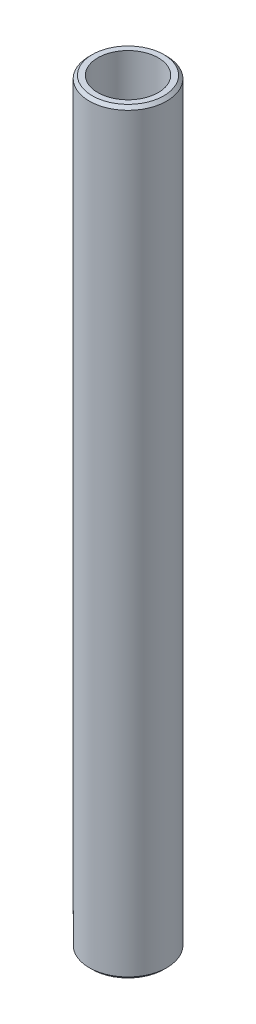
ISO-10303-21;
HEADER;
FILE_DESCRIPTION(('STEP AP214'),'2;1');
FILE_NAME('part.step','',(''),(''),'','','');
FILE_SCHEMA(('AUTOMOTIVE_DESIGN { 1 0 10303 214 1 1 1 1 }'));
ENDSEC;
DATA;
#1=APPLICATION_CONTEXT('core data for automotive mechanical design processes');
#2=APPLICATION_PROTOCOL_DEFINITION('international standard','automotive_design',2000,#1);
#3=PRODUCT_CONTEXT('',#1,'mechanical');
#4=PRODUCT('Part','Part','',(#3));
#5=PRODUCT_RELATED_PRODUCT_CATEGORY('part','',(#4));
#6=PRODUCT_DEFINITION_FORMATION('','',#4);
#7=PRODUCT_DEFINITION_CONTEXT('part definition',#1,'design');
#8=PRODUCT_DEFINITION('design','',#6,#7);
#9=PRODUCT_DEFINITION_SHAPE('','',#8);
#10=(LENGTH_UNIT() NAMED_UNIT(*) SI_UNIT(.MILLI.,.METRE.));
#11=(NAMED_UNIT(*) PLANE_ANGLE_UNIT() SI_UNIT($,.RADIAN.));
#12=(NAMED_UNIT(*) SI_UNIT($,.STERADIAN.) SOLID_ANGLE_UNIT());
#13=UNCERTAINTY_MEASURE_WITH_UNIT(LENGTH_MEASURE(1.E-05),#10,'distance_accuracy_value','');
#14=(GEOMETRIC_REPRESENTATION_CONTEXT(3) GLOBAL_UNCERTAINTY_ASSIGNED_CONTEXT((#13)) GLOBAL_UNIT_ASSIGNED_CONTEXT((#10,
#11,#12)) REPRESENTATION_CONTEXT('',''));
#15=CARTESIAN_POINT('',(0.,0.,0.));
#16=DIRECTION('',(0.,0.,1.));
#17=DIRECTION('',(1.,0.,0.));
#18=AXIS2_PLACEMENT_3D('',#15,#16,#17);
#19=CARTESIAN_POINT('',(0.,341.243062089075,0.));
#20=DIRECTION('',(0.,-1.,0.));
#21=DIRECTION('',(0.,0.,-1.));
#22=AXIS2_PLACEMENT_3D('',#19,#20,#21);
#23=CYLINDRICAL_SURFACE('',#22,17.5);
#24=CARTESIAN_POINT('',(0.,339.877269482755,0.));
#25=DIRECTION('',(0.,1.,0.));
#26=DIRECTION('',(0.,0.,1.));
#27=AXIS2_PLACEMENT_3D('',#24,#25,#26);
#28=CIRCLE('',#27,17.5);
#29=CARTESIAN_POINT('',(0.,339.877269482754,-17.5));
#30=VERTEX_POINT('',#29);
#31=EDGE_CURVE('E50',#30,#30,#28,.F.);
#32=ORIENTED_EDGE('',*,*,#31,.T.);
#33=EDGE_LOOP('',(#32));
#34=FACE_BOUND('',#33,.T.);
#35=CARTESIAN_POINT('',(0.,1.36579260632025,0.));
#36=DIRECTION('',(0.,1.,0.));
#37=DIRECTION('',(0.,0.,1.));
#38=AXIS2_PLACEMENT_3D('',#35,#36,#37);
#39=CIRCLE('',#38,17.5);
#40=CARTESIAN_POINT('',(0.,1.36579260632025,17.5));
#41=VERTEX_POINT('',#40);
#42=EDGE_CURVE('E51',#41,#41,#39,.T.);
#43=ORIENTED_EDGE('',*,*,#42,.T.);
#44=EDGE_LOOP('',(#43));
#45=FACE_BOUND('',#44,.T.);
#46=ADVANCED_FACE('F39',(#34,#45),#23,.T.);
#47=CARTESIAN_POINT('',(0.,341.243062089075,0.));
#48=DIRECTION('',(0.,1.,0.));
#49=DIRECTION('',(0.,0.,1.));
#50=AXIS2_PLACEMENT_3D('',#47,#48,#49);
#51=PLANE('',#50);
#52=CARTESIAN_POINT('',(0.,341.243062089075,0.));
#53=DIRECTION('',(0.,1.,0.));
#54=DIRECTION('',(0.,0.,1.));
#55=AXIS2_PLACEMENT_3D('',#52,#53,#54);
#56=CIRCLE('',#55,16.1342073936798);
#57=CARTESIAN_POINT('',(0.,341.243062089075,-16.1342073936799));
#58=VERTEX_POINT('',#57);
#59=EDGE_CURVE('E54',#58,#58,#56,.T.);
#60=ORIENTED_EDGE('',*,*,#59,.T.);
#61=EDGE_LOOP('',(#60));
#62=FACE_BOUND('',#61,.T.);
#63=CARTESIAN_POINT('',(0.,341.243062089075,0.));
#64=DIRECTION('',(0.,1.,0.));
#65=DIRECTION('',(0.,0.,1.));
#66=AXIS2_PLACEMENT_3D('',#63,#64,#65);
#67=CIRCLE('',#66,13.6205439947816);
#68=CARTESIAN_POINT('',(0.,341.243062089075,13.6205439947816));
#69=VERTEX_POINT('',#68);
#70=EDGE_CURVE('E58',#69,#69,#67,.T.);
#71=ORIENTED_EDGE('',*,*,#70,.F.);
#72=EDGE_LOOP('',(#71));
#73=FACE_BOUND('',#72,.T.);
#74=ADVANCED_FACE('F69',(#62,#73),#51,.T.);
#75=CARTESIAN_POINT('',(0.,0.,0.));
#76=DIRECTION('',(0.,1.,0.));
#77=DIRECTION('',(0.,0.,1.));
#78=AXIS2_PLACEMENT_3D('',#75,#76,#77);
#79=PLANE('',#78);
#80=CARTESIAN_POINT('',(0.,0.,0.));
#81=DIRECTION('',(0.,1.,0.));
#82=DIRECTION('',(0.,0.,1.));
#83=AXIS2_PLACEMENT_3D('',#80,#81,#82);
#84=CIRCLE('',#83,16.1342073936798);
#85=CARTESIAN_POINT('',(0.,0.,16.1342073936798));
#86=VERTEX_POINT('',#85);
#87=EDGE_CURVE('E10',#86,#86,#84,.F.);
#88=ORIENTED_EDGE('',*,*,#87,.T.);
#89=EDGE_LOOP('',(#88));
#90=FACE_BOUND('',#89,.T.);
#91=CARTESIAN_POINT('',(0.,0.,0.));
#92=DIRECTION('',(0.,1.,0.));
#93=DIRECTION('',(0.,0.,1.));
#94=AXIS2_PLACEMENT_3D('',#91,#92,#93);
#95=CIRCLE('',#94,13.6205439947816);
#96=CARTESIAN_POINT('',(0.,0.,13.6205439947816));
#97=VERTEX_POINT('',#96);
#98=EDGE_CURVE('E63',#97,#97,#95,.T.);
#99=ORIENTED_EDGE('',*,*,#98,.T.);
#100=EDGE_LOOP('',(#99));
#101=FACE_BOUND('',#100,.T.);
#102=ADVANCED_FACE('F75',(#90,#101),#79,.F.);
#103=CARTESIAN_POINT('',(0.,341.243062089075,0.));
#104=DIRECTION('',(0.,-1.,0.));
#105=DIRECTION('',(0.,0.,-1.));
#106=AXIS2_PLACEMENT_3D('',#103,#104,#105);
#107=CYLINDRICAL_SURFACE('',#106,13.6205439947816);
#108=ORIENTED_EDGE('',*,*,#70,.T.);
#109=EDGE_LOOP('',(#108));
#110=FACE_BOUND('',#109,.T.);
#111=ORIENTED_EDGE('',*,*,#98,.F.);
#112=EDGE_LOOP('',(#111));
#113=FACE_BOUND('',#112,.T.);
#114=ADVANCED_FACE('F70',(#110,#113),#107,.F.);
#115=CARTESIAN_POINT('',(0.,341.243062089075,0.));
#116=DIRECTION('',(0.,-1.,0.));
#117=DIRECTION('',(0.,0.,-1.));
#118=AXIS2_PLACEMENT_3D('',#115,#116,#117);
#119=CONICAL_SURFACE('',#118,16.1342073936798,0.785398163397445);
#120=CARTESIAN_POINT('',(0.,339.877269482754,-17.5));
#121=CARTESIAN_POINT('',(0.,339.89149648907,-17.4857729936842));
#122=CARTESIAN_POINT('',(0.,339.905723495386,-17.4715459873684));
#123=CARTESIAN_POINT('',(0.,339.934177508018,-17.4430919747367));
#124=CARTESIAN_POINT('',(0.,339.948404514334,-17.4288649684209));
#125=CARTESIAN_POINT('',(0.,339.976858526965,-17.4004109557892));
#126=CARTESIAN_POINT('',(0.,339.991085533281,-17.3861839494733));
#127=CARTESIAN_POINT('',(0.,340.019539545913,-17.3577299368417));
#128=CARTESIAN_POINT('',(0.,340.033766552229,-17.3435029305258));
#129=CARTESIAN_POINT('',(0.,340.06222056486,-17.3150489178942));
#130=CARTESIAN_POINT('',(0.,340.076447571176,-17.3008219115783));
#131=CARTESIAN_POINT('',(0.,340.104901583808,-17.2723678989467));
#132=CARTESIAN_POINT('',(0.,340.119128590124,-17.2581408926308));
#133=CARTESIAN_POINT('',(0.,340.147582602755,-17.2296868799992));
#134=CARTESIAN_POINT('',(0.,340.161809609071,-17.2154598736833));
#135=CARTESIAN_POINT('',(0.,340.190263621703,-17.1870058610517));
#136=CARTESIAN_POINT('',(0.,340.204490628019,-17.1727788547358));
#137=CARTESIAN_POINT('',(0.,340.23294464065,-17.1443248421042));
#138=CARTESIAN_POINT('',(0.,340.247171646966,-17.1300978357883));
#139=CARTESIAN_POINT('',(0.,340.275625659598,-17.1016438231567));
#140=CARTESIAN_POINT('',(0.,340.289852665914,-17.0874168168408));
#141=CARTESIAN_POINT('',(0.,340.318306678545,-17.0589628042091));
#142=CARTESIAN_POINT('',(0.,340.332533684861,-17.0447357978933));
#143=CARTESIAN_POINT('',(0.,340.360987697493,-17.0162817852616));
#144=CARTESIAN_POINT('',(0.,340.375214703809,-17.0020547789458));
#145=CARTESIAN_POINT('',(0.,340.40366871644,-16.9736007663141));
#146=CARTESIAN_POINT('',(0.,340.417895722756,-16.9593737599983));
#147=CARTESIAN_POINT('',(0.,340.446349735388,-16.9309197473666));
#148=CARTESIAN_POINT('',(0.,340.460576741704,-16.9166927410508));
#149=CARTESIAN_POINT('',(0.,340.489030754335,-16.8882387284191));
#150=CARTESIAN_POINT('',(0.,340.503257760651,-16.8740117221033));
#151=CARTESIAN_POINT('',(0.,340.531711773283,-16.8455577094716));
#152=CARTESIAN_POINT('',(0.,340.545938779599,-16.8313307031558));
#153=CARTESIAN_POINT('',(0.,340.57439279223,-16.8028766905241));
#154=CARTESIAN_POINT('',(0.,340.588619798546,-16.7886496842083));
#155=CARTESIAN_POINT('',(0.,340.617073811178,-16.7601956715766));
#156=CARTESIAN_POINT('',(0.,340.631300817494,-16.7459686652608));
#157=CARTESIAN_POINT('',(0.,340.659754830125,-16.7175146526291));
#158=CARTESIAN_POINT('',(0.,340.673981836441,-16.7032876463133));
#159=CARTESIAN_POINT('',(0.,340.702435849073,-16.6748336336816));
#160=CARTESIAN_POINT('',(0.,340.716662855389,-16.6606066273658));
#161=CARTESIAN_POINT('',(0.,340.74511686802,-16.6321526147341));
#162=CARTESIAN_POINT('',(0.,340.759343874336,-16.6179256084182));
#163=CARTESIAN_POINT('',(0.,340.787797886968,-16.5894715957866));
#164=CARTESIAN_POINT('',(0.,340.802024893284,-16.5752445894707));
#165=CARTESIAN_POINT('',(0.,340.830478905915,-16.5467905768391));
#166=CARTESIAN_POINT('',(0.,340.844705912231,-16.5325635705232));
#167=CARTESIAN_POINT('',(0.,340.873159924863,-16.5041095578916));
#168=CARTESIAN_POINT('',(0.,340.887386931179,-16.4898825515757));
#169=CARTESIAN_POINT('',(0.,340.915840943811,-16.4614285389441));
#170=CARTESIAN_POINT('',(0.,340.930067950126,-16.4472015326282));
#171=CARTESIAN_POINT('',(0.,340.958521962758,-16.4187475199966));
#172=CARTESIAN_POINT('',(0.,340.972748969074,-16.4045205136807));
#173=CARTESIAN_POINT('',(0.,341.001202981705,-16.376066501049));
#174=CARTESIAN_POINT('',(0.,341.015429988021,-16.3618394947332));
#175=CARTESIAN_POINT('',(0.,341.043884000653,-16.3333854821015));
#176=CARTESIAN_POINT('',(0.,341.058111006969,-16.3191584757857));
#177=CARTESIAN_POINT('',(0.,341.0865650196,-16.290704463154));
#178=CARTESIAN_POINT('',(0.,341.100792025916,-16.2764774568382));
#179=CARTESIAN_POINT('',(0.,341.129246038548,-16.2480234442065));
#180=CARTESIAN_POINT('',(0.,341.143473044864,-16.2337964378907));
#181=CARTESIAN_POINT('',(0.,341.171927057496,-16.205342425259));
#182=CARTESIAN_POINT('',(0.,341.186154063811,-16.1911154189432));
#183=CARTESIAN_POINT('',(0.,341.214608076443,-16.1626614063115));
#184=CARTESIAN_POINT('',(0.,341.228835082759,-16.1484343999957));
#185=CARTESIAN_POINT('',(0.,341.243062089075,-16.1342073936799));
#186=B_SPLINE_CURVE_WITH_KNOTS('',3,(#120,#121,#122,#123,#124,#125,#126,#127,#128,#129,#130,
#131,#132,#133,#134,#135,#136,#137,#138,#139,#140,#141,#142,#143,#144,#145,#146,#147,#148,#149,
#150,#151,#152,#153,#154,#155,#156,#157,#158,#159,#160,#161,#162,#163,#164,#165,#166,#167,#168,
#169,#170,#171,#172,#173,#174,#175,#176,#177,#178,#179,#180,#181,#182,#183,#184,#185),
.UNSPECIFIED.,.F.,.F.,(4,2,2,2,2,2,2,2,2,2,2,2,2,2,2,2,2,2,2,2,2,2,2,2,2,2,2,2,2,2,2,2,4),(0.,
0.0603600758515004,0.120720151702962,0.181080227554423,0.241440303405881,0.301800379257343,
0.362160455108804,0.422520530960265,0.482880606811726,0.543240682663226,0.603600758514688,
0.663960834366149,0.72432091021761,0.784680986069071,0.845041061920532,0.905401137771993,
0.965761213623452,1.02612128947495,1.08648136532641,1.14684144117787,1.20720151702934,
1.2675615928808,1.32792166873226,1.38828174458372,1.44864182043522,1.50900189628668,
1.56936197213814,1.6297220479896,1.69008212384106,1.75044219969252,1.81080227554398,
1.87116235139545,1.93152242724695),.UNSPECIFIED.);
#187=EDGE_CURVE('BSEAM81',#30,#58,#186,.T.);
#188=ORIENTED_EDGE('',*,*,#31,.F.);
#189=ORIENTED_EDGE('',*,*,#59,.F.);
#190=ORIENTED_EDGE('',*,*,#187,.T.);
#191=ORIENTED_EDGE('',*,*,#187,.F.);
#192=EDGE_LOOP('',(#188,#190,#189,#191));
#193=FACE_BOUND('',#192,.T.);
#194=ADVANCED_FACE('F81',(#193),#119,.T.);
#195=CARTESIAN_POINT('',(0.,1.36579260632025,0.));
#196=DIRECTION('',(0.,1.,0.));
#197=DIRECTION('',(0.,0.,1.));
#198=AXIS2_PLACEMENT_3D('',#195,#196,#197);
#199=CONICAL_SURFACE('',#198,17.5,0.785398163397434);
#200=ORIENTED_EDGE('',*,*,#87,.F.);
#201=EDGE_LOOP('',(#200));
#202=FACE_BOUND('',#201,.T.);
#203=ORIENTED_EDGE('',*,*,#42,.F.);
#204=EDGE_LOOP('',(#203));
#205=FACE_BOUND('',#204,.T.);
#206=ADVANCED_FACE('F45',(#202,#205),#199,.T.);
#207=CLOSED_SHELL('',(#46,#74,#102,#114,#194,#206));
#208=MANIFOLD_SOLID_BREP('B2',#207);
#209=ADVANCED_BREP_SHAPE_REPRESENTATION('',(#18,#208),#14);
#210=SHAPE_DEFINITION_REPRESENTATION(#9,#209);
ENDSEC;
END-ISO-10303-21;
